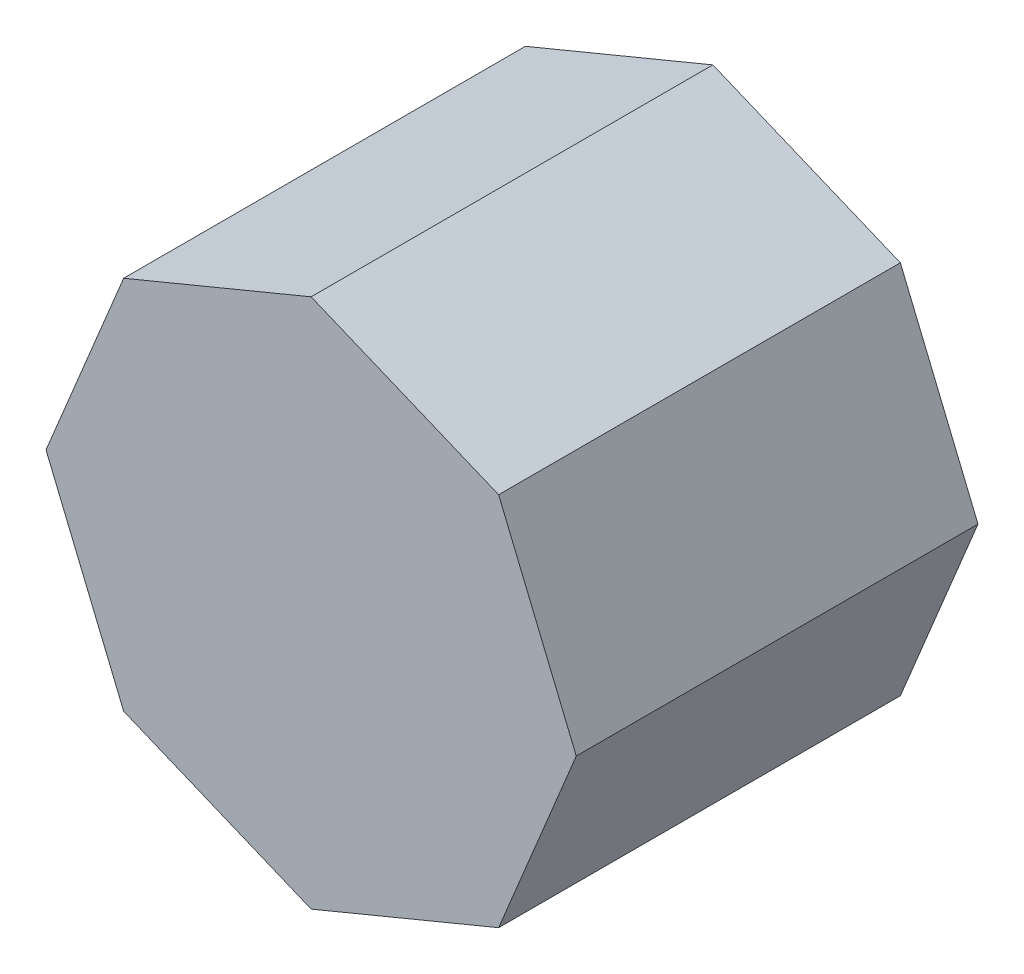
ISO-10303-21;
HEADER;
FILE_DESCRIPTION(('STEP AP214'),'2;1');
FILE_NAME('part.step','',(''),(''),'','','');
FILE_SCHEMA(('AUTOMOTIVE_DESIGN { 1 0 10303 214 1 1 1 1 }'));
ENDSEC;
DATA;
#1=APPLICATION_CONTEXT('core data for automotive mechanical design processes');
#2=APPLICATION_PROTOCOL_DEFINITION('international standard','automotive_design',2000,#1);
#3=PRODUCT_CONTEXT('',#1,'mechanical');
#4=PRODUCT('Part','Part','',(#3));
#5=PRODUCT_RELATED_PRODUCT_CATEGORY('part','',(#4));
#6=PRODUCT_DEFINITION_FORMATION('','',#4);
#7=PRODUCT_DEFINITION_CONTEXT('part definition',#1,'design');
#8=PRODUCT_DEFINITION('design','',#6,#7);
#9=PRODUCT_DEFINITION_SHAPE('','',#8);
#10=(LENGTH_UNIT() NAMED_UNIT(*) SI_UNIT(.MILLI.,.METRE.));
#11=(NAMED_UNIT(*) PLANE_ANGLE_UNIT() SI_UNIT($,.RADIAN.));
#12=(NAMED_UNIT(*) SI_UNIT($,.STERADIAN.) SOLID_ANGLE_UNIT());
#13=UNCERTAINTY_MEASURE_WITH_UNIT(LENGTH_MEASURE(1.E-05),#10,'distance_accuracy_value','');
#14=(GEOMETRIC_REPRESENTATION_CONTEXT(3) GLOBAL_UNCERTAINTY_ASSIGNED_CONTEXT((#13)) GLOBAL_UNIT_ASSIGNED_CONTEXT((#10,
#11,#12)) REPRESENTATION_CONTEXT('',''));
#15=CARTESIAN_POINT('',(0.,0.,0.));
#16=DIRECTION('',(0.,0.,1.));
#17=DIRECTION('',(1.,0.,0.));
#18=AXIS2_PLACEMENT_3D('',#15,#16,#17);
#19=CARTESIAN_POINT('',(-0.1374648,-0.381,0.20828));
#20=DIRECTION('',(0.,0.,-1.));
#21=DIRECTION('',(0.,-1.,0.));
#22=AXIS2_PLACEMENT_3D('',#19,#20,#21);
#23=PLANE('',#22);
#24=DIRECTION('',(0.382672329254966,-0.92388413149192,0.));
#25=VECTOR('',#24,1.);
#26=CARTESIAN_POINT('',(-0.1374648,-0.381,0.20828));
#27=LINE('',#26,#25);
#28=CARTESIAN_POINT('',(-0.1374648,-0.381,0.20828));
#29=VERTEX_POINT('',#28);
#30=CARTESIAN_POINT('',(-0.09720326,-0.47820326,0.20828));
#31=VERTEX_POINT('',#30);
#32=EDGE_CURVE('E111',#29,#31,#27,.T.);
#33=ORIENTED_EDGE('',*,*,#32,.T.);
#34=DIRECTION('',(0.92388413149192,-0.382672329254966,0.));
#35=VECTOR('',#34,1.);
#36=CARTESIAN_POINT('',(-0.09720326,-0.47820326,0.20828));
#37=LINE('',#36,#35);
#38=CARTESIAN_POINT('',(0.,-0.5184648,0.20828));
#39=VERTEX_POINT('',#38);
#40=EDGE_CURVE('E109',#31,#39,#37,.T.);
#41=ORIENTED_EDGE('',*,*,#40,.T.);
#42=DIRECTION('',(0.92388413149192,0.382672329254966,0.));
#43=VECTOR('',#42,1.);
#44=CARTESIAN_POINT('',(0.,-0.5184648,0.20828));
#45=LINE('',#44,#43);
#46=CARTESIAN_POINT('',(0.09720326,-0.47820326,0.20828));
#47=VERTEX_POINT('',#46);
#48=EDGE_CURVE('E94',#39,#47,#45,.T.);
#49=ORIENTED_EDGE('',*,*,#48,.T.);
#50=DIRECTION('',(0.382672329254966,0.92388413149192,0.));
#51=VECTOR('',#50,1.);
#52=CARTESIAN_POINT('',(0.09720326,-0.47820326,0.20828));
#53=LINE('',#52,#51);
#54=CARTESIAN_POINT('',(0.1374648,-0.381,0.20828));
#55=VERTEX_POINT('',#54);
#56=EDGE_CURVE('E169',#47,#55,#53,.T.);
#57=ORIENTED_EDGE('',*,*,#56,.T.);
#58=DIRECTION('',(-0.382672329254966,0.92388413149192,0.));
#59=VECTOR('',#58,1.);
#60=CARTESIAN_POINT('',(0.1374648,-0.381,0.20828));
#61=LINE('',#60,#59);
#62=CARTESIAN_POINT('',(0.09720326,-0.28379674,0.20828));
#63=VERTEX_POINT('',#62);
#64=EDGE_CURVE('E159',#55,#63,#61,.T.);
#65=ORIENTED_EDGE('',*,*,#64,.T.);
#66=DIRECTION('',(-0.92388413149192,0.382672329254966,0.));
#67=VECTOR('',#66,1.);
#68=CARTESIAN_POINT('',(0.09720326,-0.28379674,0.20828));
#69=LINE('',#68,#67);
#70=CARTESIAN_POINT('',(0.,-0.2435352,0.20828));
#71=VERTEX_POINT('',#70);
#72=EDGE_CURVE('E143',#63,#71,#69,.T.);
#73=ORIENTED_EDGE('',*,*,#72,.T.);
#74=DIRECTION('',(-0.92388413149192,-0.382672329254966,0.));
#75=VECTOR('',#74,1.);
#76=CARTESIAN_POINT('',(0.,-0.2435352,0.20828));
#77=LINE('',#76,#75);
#78=CARTESIAN_POINT('',(-0.09720326,-0.28379674,0.20828));
#79=VERTEX_POINT('',#78);
#80=EDGE_CURVE('E146',#71,#79,#77,.T.);
#81=ORIENTED_EDGE('',*,*,#80,.T.);
#82=DIRECTION('',(-0.382672329254966,-0.92388413149192,0.));
#83=VECTOR('',#82,1.);
#84=CARTESIAN_POINT('',(-0.09720326,-0.28379674,0.20828));
#85=LINE('',#84,#83);
#86=EDGE_CURVE('E11',#79,#29,#85,.T.);
#87=ORIENTED_EDGE('',*,*,#86,.T.);
#88=EDGE_LOOP('',(#33,#41,#49,#57,#65,#73,#81,#87));
#89=FACE_BOUND('',#88,.T.);
#90=ADVANCED_FACE('F17',(#89),#23,.F.);
#91=CARTESIAN_POINT('',(-0.1374648,-0.381,0.));
#92=DIRECTION('',(0.,0.,-1.));
#93=DIRECTION('',(0.,-1.,0.));
#94=AXIS2_PLACEMENT_3D('',#91,#92,#93);
#95=PLANE('',#94);
#96=DIRECTION('',(-0.382672329254966,-0.92388413149192,0.));
#97=VECTOR('',#96,1.);
#98=CARTESIAN_POINT('',(-0.09720326,-0.28379674,0.));
#99=LINE('',#98,#97);
#100=CARTESIAN_POINT('',(-0.09720326,-0.28379674,0.));
#101=VERTEX_POINT('',#100);
#102=CARTESIAN_POINT('',(-0.1374648,-0.381,0.));
#103=VERTEX_POINT('',#102);
#104=EDGE_CURVE('E28',#101,#103,#99,.T.);
#105=ORIENTED_EDGE('',*,*,#104,.F.);
#106=DIRECTION('',(-0.92388413149192,-0.382672329254966,0.));
#107=VECTOR('',#106,1.);
#108=CARTESIAN_POINT('',(0.,-0.2435352,0.));
#109=LINE('',#108,#107);
#110=CARTESIAN_POINT('',(0.,-0.2435352,0.));
#111=VERTEX_POINT('',#110);
#112=EDGE_CURVE('E150',#111,#101,#109,.T.);
#113=ORIENTED_EDGE('',*,*,#112,.F.);
#114=DIRECTION('',(-0.92388413149192,0.382672329254966,0.));
#115=VECTOR('',#114,1.);
#116=CARTESIAN_POINT('',(0.09720326,-0.28379674,0.));
#117=LINE('',#116,#115);
#118=CARTESIAN_POINT('',(0.09720326,-0.28379674,0.));
#119=VERTEX_POINT('',#118);
#120=EDGE_CURVE('E144',#119,#111,#117,.T.);
#121=ORIENTED_EDGE('',*,*,#120,.F.);
#122=DIRECTION('',(-0.382672329254966,0.92388413149192,0.));
#123=VECTOR('',#122,1.);
#124=CARTESIAN_POINT('',(0.1374648,-0.381,0.));
#125=LINE('',#124,#123);
#126=CARTESIAN_POINT('',(0.1374648,-0.381,0.));
#127=VERTEX_POINT('',#126);
#128=EDGE_CURVE('E165',#127,#119,#125,.T.);
#129=ORIENTED_EDGE('',*,*,#128,.F.);
#130=DIRECTION('',(0.382672329254966,0.92388413149192,0.));
#131=VECTOR('',#130,1.);
#132=CARTESIAN_POINT('',(0.09720326,-0.47820326,0.));
#133=LINE('',#132,#131);
#134=CARTESIAN_POINT('',(0.09720326,-0.47820326,0.));
#135=VERTEX_POINT('',#134);
#136=EDGE_CURVE('E106',#135,#127,#133,.T.);
#137=ORIENTED_EDGE('',*,*,#136,.F.);
#138=DIRECTION('',(0.92388413149192,0.382672329254966,0.));
#139=VECTOR('',#138,1.);
#140=CARTESIAN_POINT('',(0.,-0.5184648,0.));
#141=LINE('',#140,#139);
#142=CARTESIAN_POINT('',(0.,-0.5184648,0.));
#143=VERTEX_POINT('',#142);
#144=EDGE_CURVE('E116',#143,#135,#141,.T.);
#145=ORIENTED_EDGE('',*,*,#144,.F.);
#146=DIRECTION('',(0.92388413149192,-0.382672329254966,0.));
#147=VECTOR('',#146,1.);
#148=CARTESIAN_POINT('',(-0.09720326,-0.47820326,0.));
#149=LINE('',#148,#147);
#150=CARTESIAN_POINT('',(-0.09720326,-0.47820326,0.));
#151=VERTEX_POINT('',#150);
#152=EDGE_CURVE('E120',#151,#143,#149,.T.);
#153=ORIENTED_EDGE('',*,*,#152,.F.);
#154=DIRECTION('',(0.382672329254966,-0.92388413149192,0.));
#155=VECTOR('',#154,1.);
#156=CARTESIAN_POINT('',(-0.1374648,-0.381,0.));
#157=LINE('',#156,#155);
#158=EDGE_CURVE('E132',#103,#151,#157,.T.);
#159=ORIENTED_EDGE('',*,*,#158,.F.);
#160=EDGE_LOOP('',(#105,#113,#121,#129,#137,#145,#153,#159));
#161=FACE_BOUND('',#160,.T.);
#162=ADVANCED_FACE('F197',(#161),#95,.T.);
#163=CARTESIAN_POINT('',(-0.09720326,-0.28379674,0.));
#164=DIRECTION('',(0.92388413149192,-0.382672329254966,0.));
#165=DIRECTION('',(0.,0.,-1.));
#166=AXIS2_PLACEMENT_3D('',#163,#164,#165);
#167=PLANE('',#166);
#168=ORIENTED_EDGE('',*,*,#104,.T.);
#169=DIRECTION('',(0.,0.,1.));
#170=VECTOR('',#169,1.);
#171=CARTESIAN_POINT('',(-0.1374648,-0.381,0.));
#172=LINE('',#171,#170);
#173=EDGE_CURVE('E126',#103,#29,#172,.T.);
#174=ORIENTED_EDGE('',*,*,#173,.T.);
#175=ORIENTED_EDGE('',*,*,#86,.F.);
#176=DIRECTION('',(0.,0.,1.));
#177=VECTOR('',#176,1.);
#178=CARTESIAN_POINT('',(-0.09720326,-0.28379674,0.));
#179=LINE('',#178,#177);
#180=EDGE_CURVE('E149',#101,#79,#179,.T.);
#181=ORIENTED_EDGE('',*,*,#180,.F.);
#182=EDGE_LOOP('',(#168,#174,#175,#181));
#183=FACE_BOUND('',#182,.T.);
#184=ADVANCED_FACE('F191',(#183),#167,.F.);
#185=CARTESIAN_POINT('',(0.,-0.2435352,0.));
#186=DIRECTION('',(0.382672329254966,-0.92388413149192,0.));
#187=DIRECTION('',(0.,0.,-1.));
#188=AXIS2_PLACEMENT_3D('',#185,#186,#187);
#189=PLANE('',#188);
#190=ORIENTED_EDGE('',*,*,#112,.T.);
#191=ORIENTED_EDGE('',*,*,#180,.T.);
#192=ORIENTED_EDGE('',*,*,#80,.F.);
#193=DIRECTION('',(0.,0.,1.));
#194=VECTOR('',#193,1.);
#195=CARTESIAN_POINT('',(0.,-0.2435352,0.));
#196=LINE('',#195,#194);
#197=EDGE_CURVE('E140',#111,#71,#196,.T.);
#198=ORIENTED_EDGE('',*,*,#197,.F.);
#199=EDGE_LOOP('',(#190,#191,#192,#198));
#200=FACE_BOUND('',#199,.T.);
#201=ADVANCED_FACE('F19',(#200),#189,.F.);
#202=CARTESIAN_POINT('',(0.09720326,-0.28379674,0.));
#203=DIRECTION('',(-0.382672329254966,-0.92388413149192,0.));
#204=DIRECTION('',(-0.92388413149192,0.382672329254966,0.));
#205=AXIS2_PLACEMENT_3D('',#202,#203,#204);
#206=PLANE('',#205);
#207=ORIENTED_EDGE('',*,*,#120,.T.);
#208=ORIENTED_EDGE('',*,*,#197,.T.);
#209=ORIENTED_EDGE('',*,*,#72,.F.);
#210=DIRECTION('',(0.,0.,1.));
#211=VECTOR('',#210,1.);
#212=CARTESIAN_POINT('',(0.09720326,-0.28379674,0.));
#213=LINE('',#212,#211);
#214=EDGE_CURVE('E21',#119,#63,#213,.T.);
#215=ORIENTED_EDGE('',*,*,#214,.F.);
#216=EDGE_LOOP('',(#207,#208,#209,#215));
#217=FACE_BOUND('',#216,.T.);
#218=ADVANCED_FACE('F373',(#217),#206,.F.);
#219=CARTESIAN_POINT('',(0.1374648,-0.381,0.));
#220=DIRECTION('',(-0.92388413149192,-0.382672329254966,0.));
#221=DIRECTION('',(-0.382672329254966,0.92388413149192,0.));
#222=AXIS2_PLACEMENT_3D('',#219,#220,#221);
#223=PLANE('',#222);
#224=ORIENTED_EDGE('',*,*,#128,.T.);
#225=ORIENTED_EDGE('',*,*,#214,.T.);
#226=ORIENTED_EDGE('',*,*,#64,.F.);
#227=DIRECTION('',(0.,0.,1.));
#228=VECTOR('',#227,1.);
#229=CARTESIAN_POINT('',(0.1374648,-0.381,0.));
#230=LINE('',#229,#228);
#231=EDGE_CURVE('E139',#127,#55,#230,.T.);
#232=ORIENTED_EDGE('',*,*,#231,.F.);
#233=EDGE_LOOP('',(#224,#225,#226,#232));
#234=FACE_BOUND('',#233,.T.);
#235=ADVANCED_FACE('F255',(#234),#223,.F.);
#236=CARTESIAN_POINT('',(0.09720326,-0.47820326,0.));
#237=DIRECTION('',(-0.92388413149192,0.382672329254966,0.));
#238=DIRECTION('',(0.,0.,1.));
#239=AXIS2_PLACEMENT_3D('',#236,#237,#238);
#240=PLANE('',#239);
#241=ORIENTED_EDGE('',*,*,#136,.T.);
#242=ORIENTED_EDGE('',*,*,#231,.T.);
#243=ORIENTED_EDGE('',*,*,#56,.F.);
#244=DIRECTION('',(0.,0.,1.));
#245=VECTOR('',#244,1.);
#246=CARTESIAN_POINT('',(0.09720326,-0.47820326,0.));
#247=LINE('',#246,#245);
#248=EDGE_CURVE('E102',#135,#47,#247,.T.);
#249=ORIENTED_EDGE('',*,*,#248,.F.);
#250=EDGE_LOOP('',(#241,#242,#243,#249));
#251=FACE_BOUND('',#250,.T.);
#252=ADVANCED_FACE('F251',(#251),#240,.F.);
#253=CARTESIAN_POINT('',(0.,-0.5184648,0.));
#254=DIRECTION('',(-0.382672329254966,0.92388413149192,0.));
#255=DIRECTION('',(0.,0.,1.));
#256=AXIS2_PLACEMENT_3D('',#253,#254,#255);
#257=PLANE('',#256);
#258=ORIENTED_EDGE('',*,*,#144,.T.);
#259=ORIENTED_EDGE('',*,*,#248,.T.);
#260=ORIENTED_EDGE('',*,*,#48,.F.);
#261=DIRECTION('',(0.,0.,1.));
#262=VECTOR('',#261,1.);
#263=CARTESIAN_POINT('',(0.,-0.5184648,0.));
#264=LINE('',#263,#262);
#265=EDGE_CURVE('E99',#143,#39,#264,.T.);
#266=ORIENTED_EDGE('',*,*,#265,.F.);
#267=EDGE_LOOP('',(#258,#259,#260,#266));
#268=FACE_BOUND('',#267,.T.);
#269=ADVANCED_FACE('F97',(#268),#257,.F.);
#270=CARTESIAN_POINT('',(-0.09720326,-0.47820326,0.));
#271=DIRECTION('',(0.382672329254966,0.92388413149192,0.));
#272=DIRECTION('',(0.,0.,-1.));
#273=AXIS2_PLACEMENT_3D('',#270,#271,#272);
#274=PLANE('',#273);
#275=ORIENTED_EDGE('',*,*,#152,.T.);
#276=ORIENTED_EDGE('',*,*,#265,.T.);
#277=ORIENTED_EDGE('',*,*,#40,.F.);
#278=DIRECTION('',(0.,0.,1.));
#279=VECTOR('',#278,1.);
#280=CARTESIAN_POINT('',(-0.09720326,-0.47820326,0.));
#281=LINE('',#280,#279);
#282=EDGE_CURVE('E131',#151,#31,#281,.T.);
#283=ORIENTED_EDGE('',*,*,#282,.F.);
#284=EDGE_LOOP('',(#275,#276,#277,#283));
#285=FACE_BOUND('',#284,.T.);
#286=ADVANCED_FACE('F118',(#285),#274,.F.);
#287=CARTESIAN_POINT('',(-0.1374648,-0.381,0.));
#288=DIRECTION('',(0.92388413149192,0.382672329254966,0.));
#289=DIRECTION('',(0.,0.,-1.));
#290=AXIS2_PLACEMENT_3D('',#287,#288,#289);
#291=PLANE('',#290);
#292=ORIENTED_EDGE('',*,*,#158,.T.);
#293=ORIENTED_EDGE('',*,*,#282,.T.);
#294=ORIENTED_EDGE('',*,*,#32,.F.);
#295=ORIENTED_EDGE('',*,*,#173,.F.);
#296=EDGE_LOOP('',(#292,#293,#294,#295));
#297=FACE_BOUND('',#296,.T.);
#298=ADVANCED_FACE('F196',(#297),#291,.F.);
#299=CLOSED_SHELL('',(#90,#162,#184,#201,#218,#235,#252,#269,#286,#298));
#300=MANIFOLD_SOLID_BREP('B1',#299);
#301=ADVANCED_BREP_SHAPE_REPRESENTATION('',(#18,#300),#14);
#302=SHAPE_DEFINITION_REPRESENTATION(#9,#301);
ENDSEC;
END-ISO-10303-21;
